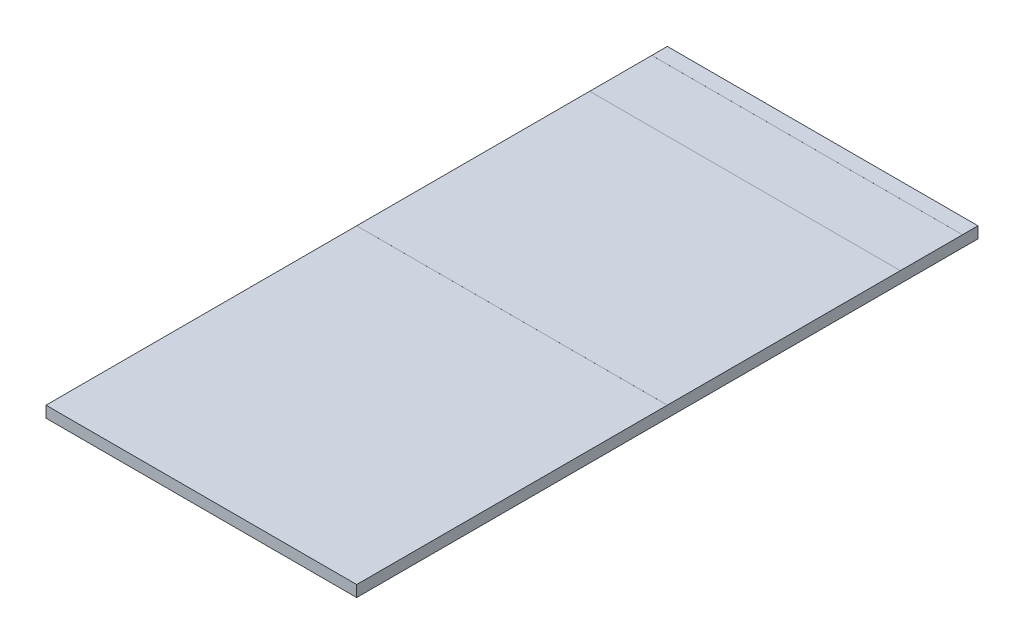
ISO-10303-21;
HEADER;
FILE_DESCRIPTION(('STEP AP214'),'2;1');
FILE_NAME('part.step','',(''),(''),'','','');
FILE_SCHEMA(('AUTOMOTIVE_DESIGN { 1 0 10303 214 1 1 1 1 }'));
ENDSEC;
DATA;
#1=APPLICATION_CONTEXT('core data for automotive mechanical design processes');
#2=APPLICATION_PROTOCOL_DEFINITION('international standard','automotive_design',2000,#1);
#3=PRODUCT_CONTEXT('',#1,'mechanical');
#4=PRODUCT('Part','Part','',(#3));
#5=PRODUCT_RELATED_PRODUCT_CATEGORY('part','',(#4));
#6=PRODUCT_DEFINITION_FORMATION('','',#4);
#7=PRODUCT_DEFINITION_CONTEXT('part definition',#1,'design');
#8=PRODUCT_DEFINITION('design','',#6,#7);
#9=PRODUCT_DEFINITION_SHAPE('','',#8);
#10=(LENGTH_UNIT() NAMED_UNIT(*) SI_UNIT(.MILLI.,.METRE.));
#11=(NAMED_UNIT(*) PLANE_ANGLE_UNIT() SI_UNIT($,.RADIAN.));
#12=(NAMED_UNIT(*) SI_UNIT($,.STERADIAN.) SOLID_ANGLE_UNIT());
#13=UNCERTAINTY_MEASURE_WITH_UNIT(LENGTH_MEASURE(1.E-05),#10,'distance_accuracy_value','');
#14=(GEOMETRIC_REPRESENTATION_CONTEXT(3) GLOBAL_UNCERTAINTY_ASSIGNED_CONTEXT((#13)) GLOBAL_UNIT_ASSIGNED_CONTEXT((#10,
#11,#12)) REPRESENTATION_CONTEXT('',''));
#15=CARTESIAN_POINT('',(0.,0.,0.));
#16=DIRECTION('',(0.,0.,1.));
#17=DIRECTION('',(1.,0.,0.));
#18=AXIS2_PLACEMENT_3D('',#15,#16,#17);
#19=CARTESIAN_POINT('',(0.,0.,4.));
#20=DIRECTION('',(0.,1.,0.));
#21=DIRECTION('',(0.,0.,1.));
#22=AXIS2_PLACEMENT_3D('',#19,#20,#21);
#23=PLANE('',#22);
#24=DIRECTION('',(0.,0.,-1.));
#25=VECTOR('',#24,1.);
#26=CARTESIAN_POINT('',(0.,0.,4.));
#27=LINE('',#26,#25);
#28=CARTESIAN_POINT('',(0.,0.,4.));
#29=VERTEX_POINT('',#28);
#30=CARTESIAN_POINT('',(0.,0.,2.));
#31=VERTEX_POINT('',#30);
#32=EDGE_CURVE('E11',#29,#31,#27,.T.);
#33=ORIENTED_EDGE('',*,*,#32,.T.);
#34=DIRECTION('',(1.,0.,0.));
#35=VECTOR('',#34,1.);
#36=CARTESIAN_POINT('',(2.,0.,2.));
#37=LINE('',#36,#35);
#38=CARTESIAN_POINT('',(2.,0.,2.));
#39=VERTEX_POINT('',#38);
#40=EDGE_CURVE('E177',#31,#39,#37,.T.);
#41=ORIENTED_EDGE('',*,*,#40,.T.);
#42=DIRECTION('',(0.,0.,-1.));
#43=VECTOR('',#42,1.);
#44=CARTESIAN_POINT('',(2.,0.,4.));
#45=LINE('',#44,#43);
#46=CARTESIAN_POINT('',(2.,0.,4.));
#47=VERTEX_POINT('',#46);
#48=EDGE_CURVE('E303',#47,#39,#45,.T.);
#49=ORIENTED_EDGE('',*,*,#48,.F.);
#50=DIRECTION('',(1.,0.,0.));
#51=VECTOR('',#50,1.);
#52=CARTESIAN_POINT('',(0.,0.,4.));
#53=LINE('',#52,#51);
#54=EDGE_CURVE('E295',#29,#47,#53,.T.);
#55=ORIENTED_EDGE('',*,*,#54,.F.);
#56=EDGE_LOOP('',(#33,#41,#49,#55));
#57=FACE_BOUND('',#56,.T.);
#58=ADVANCED_FACE('F39',(#57),#23,.F.);
#59=CARTESIAN_POINT('',(0.,0.072865,4.));
#60=DIRECTION('',(0.,1.,0.));
#61=DIRECTION('',(0.,0.,1.));
#62=AXIS2_PLACEMENT_3D('',#59,#60,#61);
#63=PLANE('',#62);
#64=DIRECTION('',(0.,0.,-1.));
#65=VECTOR('',#64,1.);
#66=CARTESIAN_POINT('',(0.,0.072865,4.));
#67=LINE('',#66,#65);
#68=CARTESIAN_POINT('',(0.,0.072865,0.5));
#69=VERTEX_POINT('',#68);
#70=CARTESIAN_POINT('',(0.,0.072865,0.1));
#71=VERTEX_POINT('',#70);
#72=EDGE_CURVE('E298',#69,#71,#67,.T.);
#73=ORIENTED_EDGE('',*,*,#72,.F.);
#74=DIRECTION('',(-1.,0.,0.));
#75=VECTOR('',#74,1.);
#76=CARTESIAN_POINT('',(2.,0.072865,0.5));
#77=LINE('',#76,#75);
#78=CARTESIAN_POINT('',(2.,0.072865,0.5));
#79=VERTEX_POINT('',#78);
#80=EDGE_CURVE('E220',#79,#69,#77,.T.);
#81=ORIENTED_EDGE('',*,*,#80,.F.);
#82=DIRECTION('',(0.,0.,-1.));
#83=VECTOR('',#82,1.);
#84=CARTESIAN_POINT('',(2.,0.072865,4.));
#85=LINE('',#84,#83);
#86=CARTESIAN_POINT('',(2.,0.072865,0.1));
#87=VERTEX_POINT('',#86);
#88=EDGE_CURVE('E308',#79,#87,#85,.T.);
#89=ORIENTED_EDGE('',*,*,#88,.T.);
#90=DIRECTION('',(1.,0.,0.));
#91=VECTOR('',#90,1.);
#92=CARTESIAN_POINT('',(2.,0.072865,0.1));
#93=LINE('',#92,#91);
#94=EDGE_CURVE('E256',#71,#87,#93,.T.);
#95=ORIENTED_EDGE('',*,*,#94,.F.);
#96=EDGE_LOOP('',(#73,#81,#89,#95));
#97=FACE_BOUND('',#96,.T.);
#98=ADVANCED_FACE('F329',(#97),#63,.T.);
#99=CARTESIAN_POINT('',(2.,0.072865,4.));
#100=VERTEX_POINT('',#99);
#101=CARTESIAN_POINT('',(2.,0.072865,2.));
#102=VERTEX_POINT('',#101);
#103=EDGE_CURVE('E305',#100,#102,#85,.T.);
#104=ORIENTED_EDGE('',*,*,#103,.T.);
#105=DIRECTION('',(1.,0.,0.));
#106=VECTOR('',#105,1.);
#107=CARTESIAN_POINT('',(2.,0.072865,2.));
#108=LINE('',#107,#106);
#109=CARTESIAN_POINT('',(0.,0.072865,2.));
#110=VERTEX_POINT('',#109);
#111=EDGE_CURVE('E229',#110,#102,#108,.T.);
#112=ORIENTED_EDGE('',*,*,#111,.F.);
#113=CARTESIAN_POINT('',(0.,0.072865,4.));
#114=VERTEX_POINT('',#113);
#115=EDGE_CURVE('E43',#114,#110,#67,.T.);
#116=ORIENTED_EDGE('',*,*,#115,.F.);
#117=DIRECTION('',(1.,0.,0.));
#118=VECTOR('',#117,1.);
#119=CARTESIAN_POINT('',(0.,0.072865,4.));
#120=LINE('',#119,#118);
#121=EDGE_CURVE('E287',#114,#100,#120,.T.);
#122=ORIENTED_EDGE('',*,*,#121,.T.);
#123=EDGE_LOOP('',(#104,#112,#116,#122));
#124=FACE_BOUND('',#123,.T.);
#125=ADVANCED_FACE('F360',(#124),#63,.T.);
#126=CARTESIAN_POINT('',(0.,0.,4.));
#127=DIRECTION('',(-1.,0.,0.));
#128=DIRECTION('',(0.,0.,1.));
#129=AXIS2_PLACEMENT_3D('',#126,#127,#128);
#130=PLANE('',#129);
#131=DIRECTION('',(0.,1.,0.));
#132=VECTOR('',#131,1.);
#133=CARTESIAN_POINT('',(0.,0.,0.));
#134=LINE('',#133,#132);
#135=CARTESIAN_POINT('',(0.,-0.0001,0.));
#136=VERTEX_POINT('',#135);
#137=CARTESIAN_POINT('',(0.,0.072965,0.));
#138=VERTEX_POINT('',#137);
#139=EDGE_CURVE('E282',#136,#138,#134,.T.);
#140=ORIENTED_EDGE('',*,*,#139,.F.);
#141=DIRECTION('',(0.,0.,1.));
#142=VECTOR('',#141,1.);
#143=CARTESIAN_POINT('',(0.,-0.0001,0.));
#144=LINE('',#143,#142);
#145=CARTESIAN_POINT('',(0.,-0.0001,0.1));
#146=VERTEX_POINT('',#145);
#147=EDGE_CURVE('E205',#136,#146,#144,.T.);
#148=ORIENTED_EDGE('',*,*,#147,.T.);
#149=DIRECTION('',(0.,1.,0.));
#150=VECTOR('',#149,1.);
#151=CARTESIAN_POINT('',(0.,-0.0001,0.1));
#152=LINE('',#151,#150);
#153=CARTESIAN_POINT('',(0.,0.,0.1));
#154=VERTEX_POINT('',#153);
#155=EDGE_CURVE('E213',#146,#154,#152,.T.);
#156=ORIENTED_EDGE('',*,*,#155,.T.);
#157=CARTESIAN_POINT('',(0.,0.,0.5));
#158=VERTEX_POINT('',#157);
#159=EDGE_CURVE('E49',#158,#154,#27,.T.);
#160=ORIENTED_EDGE('',*,*,#159,.F.);
#161=DIRECTION('',(0.,1.,0.));
#162=VECTOR('',#161,1.);
#163=CARTESIAN_POINT('',(0.,-0.0001,0.5));
#164=LINE('',#163,#162);
#165=CARTESIAN_POINT('',(0.,-0.0001,0.5));
#166=VERTEX_POINT('',#165);
#167=EDGE_CURVE('E159',#166,#158,#164,.T.);
#168=ORIENTED_EDGE('',*,*,#167,.F.);
#169=DIRECTION('',(0.,0.,1.));
#170=VECTOR('',#169,1.);
#171=CARTESIAN_POINT('',(0.,-0.0001,0.5));
#172=LINE('',#171,#170);
#173=CARTESIAN_POINT('',(0.,-0.0001,2.));
#174=VERTEX_POINT('',#173);
#175=EDGE_CURVE('E170',#166,#174,#172,.T.);
#176=ORIENTED_EDGE('',*,*,#175,.T.);
#177=DIRECTION('',(0.,1.,0.));
#178=VECTOR('',#177,1.);
#179=CARTESIAN_POINT('',(0.,-0.0001,2.));
#180=LINE('',#179,#178);
#181=EDGE_CURVE('E192',#174,#31,#180,.T.);
#182=ORIENTED_EDGE('',*,*,#181,.T.);
#183=ORIENTED_EDGE('',*,*,#32,.F.);
#184=DIRECTION('',(0.,1.,0.));
#185=VECTOR('',#184,1.);
#186=CARTESIAN_POINT('',(0.,0.,4.));
#187=LINE('',#186,#185);
#188=EDGE_CURVE('E283',#29,#114,#187,.T.);
#189=ORIENTED_EDGE('',*,*,#188,.T.);
#190=ORIENTED_EDGE('',*,*,#115,.T.);
#191=DIRECTION('',(0.,-1.,0.));
#192=VECTOR('',#191,1.);
#193=CARTESIAN_POINT('',(0.,0.072965,2.));
#194=LINE('',#193,#192);
#195=CARTESIAN_POINT('',(0.,0.072965,2.));
#196=VERTEX_POINT('',#195);
#197=EDGE_CURVE('E246',#196,#110,#194,.T.);
#198=ORIENTED_EDGE('',*,*,#197,.F.);
#199=DIRECTION('',(0.,0.,1.));
#200=VECTOR('',#199,1.);
#201=CARTESIAN_POINT('',(0.,0.072965,0.5));
#202=LINE('',#201,#200);
#203=CARTESIAN_POINT('',(0.,0.072965,0.5));
#204=VERTEX_POINT('',#203);
#205=EDGE_CURVE('E232',#204,#196,#202,.T.);
#206=ORIENTED_EDGE('',*,*,#205,.F.);
#207=DIRECTION('',(0.,-1.,0.));
#208=VECTOR('',#207,1.);
#209=CARTESIAN_POINT('',(0.,0.072965,0.5));
#210=LINE('',#209,#208);
#211=EDGE_CURVE('E249',#204,#69,#210,.T.);
#212=ORIENTED_EDGE('',*,*,#211,.T.);
#213=ORIENTED_EDGE('',*,*,#72,.T.);
#214=DIRECTION('',(0.,-1.,0.));
#215=VECTOR('',#214,1.);
#216=CARTESIAN_POINT('',(0.,0.072965,0.1));
#217=LINE('',#216,#215);
#218=CARTESIAN_POINT('',(0.,0.072965,0.1));
#219=VERTEX_POINT('',#218);
#220=EDGE_CURVE('E278',#219,#71,#217,.T.);
#221=ORIENTED_EDGE('',*,*,#220,.F.);
#222=DIRECTION('',(0.,0.,1.));
#223=VECTOR('',#222,1.);
#224=CARTESIAN_POINT('',(0.,0.072965,0.));
#225=LINE('',#224,#223);
#226=EDGE_CURVE('E265',#138,#219,#225,.T.);
#227=ORIENTED_EDGE('',*,*,#226,.F.);
#228=EDGE_LOOP('',(#140,#148,#156,#160,#168,#176,#182,#183,#189,#190,#198,#206,#212,#213,#221,#227));
#229=FACE_BOUND('',#228,.T.);
#230=ADVANCED_FACE('F41',(#229),#130,.T.);
#231=CARTESIAN_POINT('',(2.,0.,0.5));
#232=VERTEX_POINT('',#231);
#233=CARTESIAN_POINT('',(2.,0.,0.1));
#234=VERTEX_POINT('',#233);
#235=EDGE_CURVE('E64',#232,#234,#45,.T.);
#236=ORIENTED_EDGE('',*,*,#235,.F.);
#237=DIRECTION('',(-1.,0.,0.));
#238=VECTOR('',#237,1.);
#239=CARTESIAN_POINT('',(2.,0.,0.5));
#240=LINE('',#239,#238);
#241=EDGE_CURVE('E57',#232,#158,#240,.T.);
#242=ORIENTED_EDGE('',*,*,#241,.T.);
#243=ORIENTED_EDGE('',*,*,#159,.T.);
#244=DIRECTION('',(1.,0.,0.));
#245=VECTOR('',#244,1.);
#246=CARTESIAN_POINT('',(2.,0.,0.1));
#247=LINE('',#246,#245);
#248=EDGE_CURVE('E191',#154,#234,#247,.T.);
#249=ORIENTED_EDGE('',*,*,#248,.T.);
#250=EDGE_LOOP('',(#236,#242,#243,#249));
#251=FACE_BOUND('',#250,.T.);
#252=ADVANCED_FACE('F351',(#251),#23,.F.);
#253=CARTESIAN_POINT('',(2.,0.,4.));
#254=DIRECTION('',(-1.,0.,0.));
#255=DIRECTION('',(0.,0.,1.));
#256=AXIS2_PLACEMENT_3D('',#253,#254,#255);
#257=PLANE('',#256);
#258=DIRECTION('',(0.,1.,0.));
#259=VECTOR('',#258,1.);
#260=CARTESIAN_POINT('',(2.,0.,0.));
#261=LINE('',#260,#259);
#262=CARTESIAN_POINT('',(2.,-0.0001,0.));
#263=VERTEX_POINT('',#262);
#264=CARTESIAN_POINT('',(2.,0.072965,0.));
#265=VERTEX_POINT('',#264);
#266=EDGE_CURVE('E288',#263,#265,#261,.T.);
#267=ORIENTED_EDGE('',*,*,#266,.T.);
#268=DIRECTION('',(0.,0.,-1.));
#269=VECTOR('',#268,1.);
#270=CARTESIAN_POINT('',(2.,0.072965,0.));
#271=LINE('',#270,#269);
#272=CARTESIAN_POINT('',(2.,0.072965,0.1));
#273=VERTEX_POINT('',#272);
#274=EDGE_CURVE('E257',#273,#265,#271,.T.);
#275=ORIENTED_EDGE('',*,*,#274,.F.);
#276=DIRECTION('',(0.,-1.,0.));
#277=VECTOR('',#276,1.);
#278=CARTESIAN_POINT('',(2.,0.072965,0.1));
#279=LINE('',#278,#277);
#280=EDGE_CURVE('E271',#273,#87,#279,.T.);
#281=ORIENTED_EDGE('',*,*,#280,.T.);
#282=ORIENTED_EDGE('',*,*,#88,.F.);
#283=DIRECTION('',(0.,-1.,0.));
#284=VECTOR('',#283,1.);
#285=CARTESIAN_POINT('',(2.,0.072965,0.5));
#286=LINE('',#285,#284);
#287=CARTESIAN_POINT('',(2.,0.072965,0.5));
#288=VERTEX_POINT('',#287);
#289=EDGE_CURVE('E253',#288,#79,#286,.T.);
#290=ORIENTED_EDGE('',*,*,#289,.F.);
#291=DIRECTION('',(0.,0.,-1.));
#292=VECTOR('',#291,1.);
#293=CARTESIAN_POINT('',(2.,0.072965,0.5));
#294=LINE('',#293,#292);
#295=CARTESIAN_POINT('',(2.,0.072965,2.));
#296=VERTEX_POINT('',#295);
#297=EDGE_CURVE('E224',#296,#288,#294,.T.);
#298=ORIENTED_EDGE('',*,*,#297,.F.);
#299=DIRECTION('',(0.,-1.,0.));
#300=VECTOR('',#299,1.);
#301=CARTESIAN_POINT('',(2.,0.072965,2.));
#302=LINE('',#301,#300);
#303=EDGE_CURVE('E238',#296,#102,#302,.T.);
#304=ORIENTED_EDGE('',*,*,#303,.T.);
#305=ORIENTED_EDGE('',*,*,#103,.F.);
#306=DIRECTION('',(0.,1.,0.));
#307=VECTOR('',#306,1.);
#308=CARTESIAN_POINT('',(2.,0.,4.));
#309=LINE('',#308,#307);
#310=EDGE_CURVE('E292',#47,#100,#309,.T.);
#311=ORIENTED_EDGE('',*,*,#310,.F.);
#312=ORIENTED_EDGE('',*,*,#48,.T.);
#313=DIRECTION('',(0.,1.,0.));
#314=VECTOR('',#313,1.);
#315=CARTESIAN_POINT('',(2.,-0.0001,2.));
#316=LINE('',#315,#314);
#317=CARTESIAN_POINT('',(2.,-0.0001,2.));
#318=VERTEX_POINT('',#317);
#319=EDGE_CURVE('E175',#318,#39,#316,.T.);
#320=ORIENTED_EDGE('',*,*,#319,.F.);
#321=DIRECTION('',(0.,0.,-1.));
#322=VECTOR('',#321,1.);
#323=CARTESIAN_POINT('',(2.,-0.0001,0.5));
#324=LINE('',#323,#322);
#325=CARTESIAN_POINT('',(2.,-0.0001,0.5));
#326=VERTEX_POINT('',#325);
#327=EDGE_CURVE('E167',#318,#326,#324,.T.);
#328=ORIENTED_EDGE('',*,*,#327,.T.);
#329=DIRECTION('',(0.,1.,0.));
#330=VECTOR('',#329,1.);
#331=CARTESIAN_POINT('',(2.,-0.0001,0.5));
#332=LINE('',#331,#330);
#333=EDGE_CURVE('E153',#326,#232,#332,.T.);
#334=ORIENTED_EDGE('',*,*,#333,.T.);
#335=ORIENTED_EDGE('',*,*,#235,.T.);
#336=DIRECTION('',(0.,1.,0.));
#337=VECTOR('',#336,1.);
#338=CARTESIAN_POINT('',(2.,-0.0001,0.1));
#339=LINE('',#338,#337);
#340=CARTESIAN_POINT('',(2.,-0.0001,0.1));
#341=VERTEX_POINT('',#340);
#342=EDGE_CURVE('E217',#341,#234,#339,.T.);
#343=ORIENTED_EDGE('',*,*,#342,.F.);
#344=DIRECTION('',(0.,0.,-1.));
#345=VECTOR('',#344,1.);
#346=CARTESIAN_POINT('',(2.,-0.0001,0.));
#347=LINE('',#346,#345);
#348=EDGE_CURVE('E197',#341,#263,#347,.T.);
#349=ORIENTED_EDGE('',*,*,#348,.T.);
#350=EDGE_LOOP('',(#267,#275,#281,#282,#290,#298,#304,#305,#311,#312,#320,#328,#334,#335,#343,#349));
#351=FACE_BOUND('',#350,.T.);
#352=ADVANCED_FACE('F173',(#351),#257,.F.);
#353=CARTESIAN_POINT('',(0.,0.,4.));
#354=DIRECTION('',(0.,0.,-1.));
#355=DIRECTION('',(-1.,0.,0.));
#356=AXIS2_PLACEMENT_3D('',#353,#354,#355);
#357=PLANE('',#356);
#358=ORIENTED_EDGE('',*,*,#188,.F.);
#359=ORIENTED_EDGE('',*,*,#54,.T.);
#360=ORIENTED_EDGE('',*,*,#310,.T.);
#361=ORIENTED_EDGE('',*,*,#121,.F.);
#362=EDGE_LOOP('',(#358,#359,#360,#361));
#363=FACE_BOUND('',#362,.T.);
#364=ADVANCED_FACE('F358',(#363),#357,.F.);
#365=CARTESIAN_POINT('',(0.,0.,0.));
#366=DIRECTION('',(0.,0.,-1.));
#367=DIRECTION('',(-1.,0.,0.));
#368=AXIS2_PLACEMENT_3D('',#365,#366,#367);
#369=PLANE('',#368);
#370=ORIENTED_EDGE('',*,*,#139,.T.);
#371=DIRECTION('',(-1.,0.,0.));
#372=VECTOR('',#371,1.);
#373=CARTESIAN_POINT('',(2.,0.072965,0.));
#374=LINE('',#373,#372);
#375=EDGE_CURVE('E261',#265,#138,#374,.T.);
#376=ORIENTED_EDGE('',*,*,#375,.F.);
#377=ORIENTED_EDGE('',*,*,#266,.F.);
#378=DIRECTION('',(-1.,0.,0.));
#379=VECTOR('',#378,1.);
#380=CARTESIAN_POINT('',(2.,-0.0001,0.));
#381=LINE('',#380,#379);
#382=EDGE_CURVE('E201',#263,#136,#381,.T.);
#383=ORIENTED_EDGE('',*,*,#382,.T.);
#384=EDGE_LOOP('',(#370,#376,#377,#383));
#385=FACE_BOUND('',#384,.T.);
#386=ADVANCED_FACE('F344',(#385),#369,.T.);
#387=CARTESIAN_POINT('',(2.,0.072965,0.1));
#388=DIRECTION('',(0.,0.,-1.));
#389=DIRECTION('',(-1.,0.,0.));
#390=AXIS2_PLACEMENT_3D('',#387,#388,#389);
#391=PLANE('',#390);
#392=ORIENTED_EDGE('',*,*,#94,.T.);
#393=ORIENTED_EDGE('',*,*,#280,.F.);
#394=DIRECTION('',(1.,0.,0.));
#395=VECTOR('',#394,1.);
#396=CARTESIAN_POINT('',(2.,0.072965,0.1));
#397=LINE('',#396,#395);
#398=EDGE_CURVE('E268',#219,#273,#397,.T.);
#399=ORIENTED_EDGE('',*,*,#398,.F.);
#400=ORIENTED_EDGE('',*,*,#220,.T.);
#401=EDGE_LOOP('',(#392,#393,#399,#400));
#402=FACE_BOUND('',#401,.T.);
#403=ADVANCED_FACE('F332',(#402),#391,.F.);
#404=CARTESIAN_POINT('',(0.,0.072965,0.));
#405=DIRECTION('',(0.,-1.,0.));
#406=DIRECTION('',(0.,0.,-1.));
#407=AXIS2_PLACEMENT_3D('',#404,#405,#406);
#408=PLANE('',#407);
#409=ORIENTED_EDGE('',*,*,#274,.T.);
#410=ORIENTED_EDGE('',*,*,#375,.T.);
#411=ORIENTED_EDGE('',*,*,#226,.T.);
#412=ORIENTED_EDGE('',*,*,#398,.T.);
#413=EDGE_LOOP('',(#409,#410,#411,#412));
#414=FACE_BOUND('',#413,.T.);
#415=ADVANCED_FACE('F335',(#414),#408,.F.);
#416=CARTESIAN_POINT('',(2.,0.072965,0.5));
#417=DIRECTION('',(0.,0.,1.));
#418=DIRECTION('',(1.,0.,0.));
#419=AXIS2_PLACEMENT_3D('',#416,#417,#418);
#420=PLANE('',#419);
#421=ORIENTED_EDGE('',*,*,#80,.T.);
#422=ORIENTED_EDGE('',*,*,#211,.F.);
#423=DIRECTION('',(-1.,0.,0.));
#424=VECTOR('',#423,1.);
#425=CARTESIAN_POINT('',(2.,0.072965,0.5));
#426=LINE('',#425,#424);
#427=EDGE_CURVE('E228',#288,#204,#426,.T.);
#428=ORIENTED_EDGE('',*,*,#427,.F.);
#429=ORIENTED_EDGE('',*,*,#289,.T.);
#430=EDGE_LOOP('',(#421,#422,#428,#429));
#431=FACE_BOUND('',#430,.T.);
#432=ADVANCED_FACE('F392',(#431),#420,.F.);
#433=CARTESIAN_POINT('',(2.,0.072965,2.));
#434=DIRECTION('',(0.,0.,-1.));
#435=DIRECTION('',(-1.,0.,0.));
#436=AXIS2_PLACEMENT_3D('',#433,#434,#435);
#437=PLANE('',#436);
#438=ORIENTED_EDGE('',*,*,#111,.T.);
#439=ORIENTED_EDGE('',*,*,#303,.F.);
#440=DIRECTION('',(1.,0.,0.));
#441=VECTOR('',#440,1.);
#442=CARTESIAN_POINT('',(2.,0.072965,2.));
#443=LINE('',#442,#441);
#444=EDGE_CURVE('E235',#196,#296,#443,.T.);
#445=ORIENTED_EDGE('',*,*,#444,.F.);
#446=ORIENTED_EDGE('',*,*,#197,.T.);
#447=EDGE_LOOP('',(#438,#439,#445,#446));
#448=FACE_BOUND('',#447,.T.);
#449=ADVANCED_FACE('F388',(#448),#437,.F.);
#450=CARTESIAN_POINT('',(0.,0.072965,0.));
#451=DIRECTION('',(0.,-1.,0.));
#452=DIRECTION('',(0.,0.,-1.));
#453=AXIS2_PLACEMENT_3D('',#450,#451,#452);
#454=PLANE('',#453);
#455=ORIENTED_EDGE('',*,*,#297,.T.);
#456=ORIENTED_EDGE('',*,*,#427,.T.);
#457=ORIENTED_EDGE('',*,*,#205,.T.);
#458=ORIENTED_EDGE('',*,*,#444,.T.);
#459=EDGE_LOOP('',(#455,#456,#457,#458));
#460=FACE_BOUND('',#459,.T.);
#461=ADVANCED_FACE('F385',(#460),#454,.F.);
#462=CARTESIAN_POINT('',(2.,-0.0001,0.1));
#463=DIRECTION('',(0.,0.,1.));
#464=DIRECTION('',(1.,0.,0.));
#465=AXIS2_PLACEMENT_3D('',#462,#463,#464);
#466=PLANE('',#465);
#467=ORIENTED_EDGE('',*,*,#248,.F.);
#468=ORIENTED_EDGE('',*,*,#155,.F.);
#469=DIRECTION('',(1.,0.,0.));
#470=VECTOR('',#469,1.);
#471=CARTESIAN_POINT('',(2.,-0.0001,0.1));
#472=LINE('',#471,#470);
#473=EDGE_CURVE('E209',#146,#341,#472,.T.);
#474=ORIENTED_EDGE('',*,*,#473,.T.);
#475=ORIENTED_EDGE('',*,*,#342,.T.);
#476=EDGE_LOOP('',(#467,#468,#474,#475));
#477=FACE_BOUND('',#476,.T.);
#478=ADVANCED_FACE('F347',(#477),#466,.T.);
#479=CARTESIAN_POINT('',(0.,-0.0001,0.));
#480=DIRECTION('',(0.,-1.,0.));
#481=DIRECTION('',(0.,0.,-1.));
#482=AXIS2_PLACEMENT_3D('',#479,#480,#481);
#483=PLANE('',#482);
#484=ORIENTED_EDGE('',*,*,#348,.F.);
#485=ORIENTED_EDGE('',*,*,#473,.F.);
#486=ORIENTED_EDGE('',*,*,#147,.F.);
#487=ORIENTED_EDGE('',*,*,#382,.F.);
#488=EDGE_LOOP('',(#484,#485,#486,#487));
#489=FACE_BOUND('',#488,.T.);
#490=ADVANCED_FACE('F343',(#489),#483,.T.);
#491=CARTESIAN_POINT('',(2.,-0.0001,2.));
#492=DIRECTION('',(0.,0.,1.));
#493=DIRECTION('',(1.,0.,0.));
#494=AXIS2_PLACEMENT_3D('',#491,#492,#493);
#495=PLANE('',#494);
#496=ORIENTED_EDGE('',*,*,#40,.F.);
#497=ORIENTED_EDGE('',*,*,#181,.F.);
#498=DIRECTION('',(1.,0.,0.));
#499=VECTOR('',#498,1.);
#500=CARTESIAN_POINT('',(2.,-0.0001,2.));
#501=LINE('',#500,#499);
#502=EDGE_CURVE('E160',#174,#318,#501,.T.);
#503=ORIENTED_EDGE('',*,*,#502,.T.);
#504=ORIENTED_EDGE('',*,*,#319,.T.);
#505=EDGE_LOOP('',(#496,#497,#503,#504));
#506=FACE_BOUND('',#505,.T.);
#507=ADVANCED_FACE('F372',(#506),#495,.T.);
#508=CARTESIAN_POINT('',(2.,-0.0001,0.5));
#509=DIRECTION('',(0.,0.,-1.));
#510=DIRECTION('',(-1.,0.,0.));
#511=AXIS2_PLACEMENT_3D('',#508,#509,#510);
#512=PLANE('',#511);
#513=ORIENTED_EDGE('',*,*,#241,.F.);
#514=ORIENTED_EDGE('',*,*,#333,.F.);
#515=DIRECTION('',(-1.,0.,0.));
#516=VECTOR('',#515,1.);
#517=CARTESIAN_POINT('',(2.,-0.0001,0.5));
#518=LINE('',#517,#516);
#519=EDGE_CURVE('E156',#326,#166,#518,.T.);
#520=ORIENTED_EDGE('',*,*,#519,.T.);
#521=ORIENTED_EDGE('',*,*,#167,.T.);
#522=EDGE_LOOP('',(#513,#514,#520,#521));
#523=FACE_BOUND('',#522,.T.);
#524=ADVANCED_FACE('F155',(#523),#512,.T.);
#525=CARTESIAN_POINT('',(0.,-0.0001,0.));
#526=DIRECTION('',(0.,-1.,0.));
#527=DIRECTION('',(0.,0.,-1.));
#528=AXIS2_PLACEMENT_3D('',#525,#526,#527);
#529=PLANE('',#528);
#530=ORIENTED_EDGE('',*,*,#327,.F.);
#531=ORIENTED_EDGE('',*,*,#502,.F.);
#532=ORIENTED_EDGE('',*,*,#175,.F.);
#533=ORIENTED_EDGE('',*,*,#519,.F.);
#534=EDGE_LOOP('',(#530,#531,#532,#533));
#535=FACE_BOUND('',#534,.T.);
#536=ADVANCED_FACE('F165',(#535),#529,.T.);
#537=CLOSED_SHELL('',(#58,#98,#125,#230,#252,#352,#364,#386,#403,#415,#432,#449,#461,#478,#490,
#507,#524,#536));
#538=MANIFOLD_SOLID_BREP('B2',#537);
#539=ADVANCED_BREP_SHAPE_REPRESENTATION('',(#18,#538),#14);
#540=SHAPE_DEFINITION_REPRESENTATION(#9,#539);
ENDSEC;
END-ISO-10303-21;
